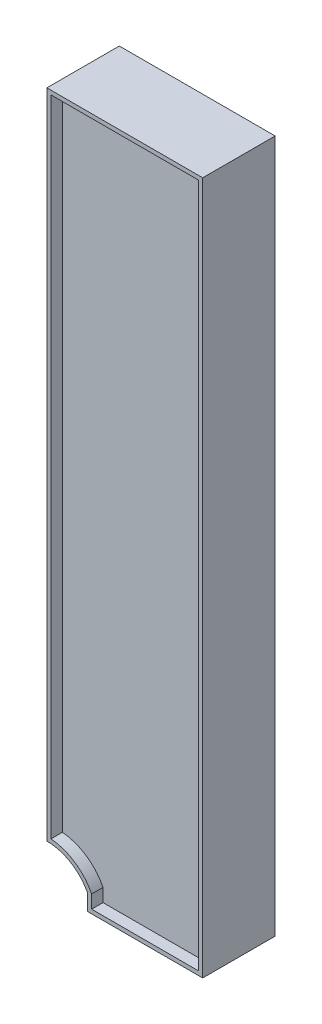
ISO-10303-21;
HEADER;
FILE_DESCRIPTION(('STEP AP214'),'2;1');
FILE_NAME('part.step','',(''),(''),'','','');
FILE_SCHEMA(('AUTOMOTIVE_DESIGN { 1 0 10303 214 1 1 1 1 }'));
ENDSEC;
DATA;
#1=APPLICATION_CONTEXT('core data for automotive mechanical design processes');
#2=APPLICATION_PROTOCOL_DEFINITION('international standard','automotive_design',2000,#1);
#3=PRODUCT_CONTEXT('',#1,'mechanical');
#4=PRODUCT('Part','Part','',(#3));
#5=PRODUCT_RELATED_PRODUCT_CATEGORY('part','',(#4));
#6=PRODUCT_DEFINITION_FORMATION('','',#4);
#7=PRODUCT_DEFINITION_CONTEXT('part definition',#1,'design');
#8=PRODUCT_DEFINITION('design','',#6,#7);
#9=PRODUCT_DEFINITION_SHAPE('','',#8);
#10=(LENGTH_UNIT() NAMED_UNIT(*) SI_UNIT(.MILLI.,.METRE.));
#11=(NAMED_UNIT(*) PLANE_ANGLE_UNIT() SI_UNIT($,.RADIAN.));
#12=(NAMED_UNIT(*) SI_UNIT($,.STERADIAN.) SOLID_ANGLE_UNIT());
#13=UNCERTAINTY_MEASURE_WITH_UNIT(LENGTH_MEASURE(1.E-05),#10,'distance_accuracy_value','');
#14=(GEOMETRIC_REPRESENTATION_CONTEXT(3) GLOBAL_UNCERTAINTY_ASSIGNED_CONTEXT((#13)) GLOBAL_UNIT_ASSIGNED_CONTEXT((#10,
#11,#12)) REPRESENTATION_CONTEXT('',''));
#15=CARTESIAN_POINT('',(0.,0.,0.));
#16=DIRECTION('',(0.,0.,1.));
#17=DIRECTION('',(1.,0.,0.));
#18=AXIS2_PLACEMENT_3D('',#15,#16,#17);
#19=CARTESIAN_POINT('',(0.,0.,0.));
#20=DIRECTION('',(0.,0.,-1.));
#21=DIRECTION('',(-1.,0.,0.));
#22=AXIS2_PLACEMENT_3D('',#19,#20,#21);
#23=PLANE('',#22);
#24=DIRECTION('',(0.,1.,0.));
#25=VECTOR('',#24,1.);
#26=CARTESIAN_POINT('',(50.,0.,0.));
#27=LINE('',#26,#25);
#28=CARTESIAN_POINT('',(50.,0.,0.));
#29=VERTEX_POINT('',#28);
#30=CARTESIAN_POINT('',(50.,20.,0.));
#31=VERTEX_POINT('',#30);
#32=EDGE_CURVE('E269',#29,#31,#27,.T.);
#33=ORIENTED_EDGE('',*,*,#32,.T.);
#34=CARTESIAN_POINT('',(0.,-6.66666666666667,0.));
#35=DIRECTION('',(0.,0.,-1.));
#36=DIRECTION('',(-1.,0.,0.));
#37=AXIS2_PLACEMENT_3D('',#34,#35,#36);
#38=CIRCLE('',#37,56.6666666666667);
#39=CARTESIAN_POINT('',(0.,50.,0.));
#40=VERTEX_POINT('',#39);
#41=EDGE_CURVE('E264',#31,#40,#38,.F.);
#42=ORIENTED_EDGE('',*,*,#41,.T.);
#43=DIRECTION('',(0.,-1.,0.));
#44=VECTOR('',#43,1.);
#45=CARTESIAN_POINT('',(0.,0.,0.));
#46=LINE('',#45,#44);
#47=CARTESIAN_POINT('',(0.,851.41,0.));
#48=VERTEX_POINT('',#47);
#49=EDGE_CURVE('E274',#48,#40,#46,.T.);
#50=ORIENTED_EDGE('',*,*,#49,.F.);
#51=DIRECTION('',(-1.,0.,0.));
#52=VECTOR('',#51,1.);
#53=CARTESIAN_POINT('',(0.,851.41,0.));
#54=LINE('',#53,#52);
#55=CARTESIAN_POINT('',(191.44,851.41,0.));
#56=VERTEX_POINT('',#55);
#57=EDGE_CURVE('E281',#56,#48,#54,.T.);
#58=ORIENTED_EDGE('',*,*,#57,.F.);
#59=DIRECTION('',(0.,1.,0.));
#60=VECTOR('',#59,1.);
#61=CARTESIAN_POINT('',(191.44,0.,0.));
#62=LINE('',#61,#60);
#63=CARTESIAN_POINT('',(191.44,0.,0.));
#64=VERTEX_POINT('',#63);
#65=EDGE_CURVE('E292',#64,#56,#62,.T.);
#66=ORIENTED_EDGE('',*,*,#65,.F.);
#67=DIRECTION('',(1.,0.,0.));
#68=VECTOR('',#67,1.);
#69=CARTESIAN_POINT('',(0.,0.,0.));
#70=LINE('',#69,#68);
#71=EDGE_CURVE('E290',#29,#64,#70,.T.);
#72=ORIENTED_EDGE('',*,*,#71,.F.);
#73=EDGE_LOOP('',(#33,#42,#50,#58,#66,#72));
#74=FACE_BOUND('',#73,.T.);
#75=DIRECTION('',(0.,-1.,0.));
#76=VECTOR('',#75,1.);
#77=CARTESIAN_POINT('',(5.,846.41,0.));
#78=LINE('',#77,#76);
#79=CARTESIAN_POINT('',(5.,846.41,0.));
#80=VERTEX_POINT('',#79);
#81=CARTESIAN_POINT('',(4.99999999999995,54.7969630486193,0.));
#82=VERTEX_POINT('',#81);
#83=EDGE_CURVE('E193',#80,#82,#78,.T.);
#84=ORIENTED_EDGE('',*,*,#83,.T.);
#85=CARTESIAN_POINT('',(0.,-6.66666666666667,0.));
#86=DIRECTION('',(0.,0.,-1.));
#87=DIRECTION('',(1.,0.,0.));
#88=AXIS2_PLACEMENT_3D('',#85,#86,#87);
#89=CIRCLE('',#88,61.6666666666667);
#90=CARTESIAN_POINT('',(55.,21.2220008844692,0.));
#91=VERTEX_POINT('',#90);
#92=EDGE_CURVE('E49',#82,#91,#89,.T.);
#93=ORIENTED_EDGE('',*,*,#92,.T.);
#94=DIRECTION('',(0.,-1.,0.));
#95=VECTOR('',#94,1.);
#96=CARTESIAN_POINT('',(55.,21.2220008844692,0.));
#97=LINE('',#96,#95);
#98=CARTESIAN_POINT('',(55.,5.,0.));
#99=VERTEX_POINT('',#98);
#100=EDGE_CURVE('E180',#91,#99,#97,.T.);
#101=ORIENTED_EDGE('',*,*,#100,.T.);
#102=DIRECTION('',(1.,0.,0.));
#103=VECTOR('',#102,1.);
#104=CARTESIAN_POINT('',(55.,5.,0.));
#105=LINE('',#104,#103);
#106=CARTESIAN_POINT('',(186.44,5.,0.));
#107=VERTEX_POINT('',#106);
#108=EDGE_CURVE('E183',#99,#107,#105,.T.);
#109=ORIENTED_EDGE('',*,*,#108,.T.);
#110=DIRECTION('',(0.,1.,0.));
#111=VECTOR('',#110,1.);
#112=CARTESIAN_POINT('',(186.44,5.,0.));
#113=LINE('',#112,#111);
#114=CARTESIAN_POINT('',(186.44,846.41,0.));
#115=VERTEX_POINT('',#114);
#116=EDGE_CURVE('E198',#107,#115,#113,.T.);
#117=ORIENTED_EDGE('',*,*,#116,.T.);
#118=DIRECTION('',(-1.,0.,0.));
#119=VECTOR('',#118,1.);
#120=CARTESIAN_POINT('',(186.44,846.41,0.));
#121=LINE('',#120,#119);
#122=EDGE_CURVE('E195',#115,#80,#121,.T.);
#123=ORIENTED_EDGE('',*,*,#122,.T.);
#124=EDGE_LOOP('',(#84,#93,#101,#109,#117,#123));
#125=FACE_BOUND('',#124,.T.);
#126=ADVANCED_FACE('F34',(#74,#125),#23,.T.);
#127=CARTESIAN_POINT('',(0.,0.,89.));
#128=DIRECTION('',(1.,0.,0.));
#129=DIRECTION('',(0.,0.,-1.));
#130=AXIS2_PLACEMENT_3D('',#127,#128,#129);
#131=PLANE('',#130);
#132=ORIENTED_EDGE('',*,*,#49,.T.);
#133=DIRECTION('',(0.,0.,1.));
#134=VECTOR('',#133,1.);
#135=CARTESIAN_POINT('',(0.,50.,-139.755997434306));
#136=LINE('',#135,#134);
#137=CARTESIAN_POINT('',(0.,50.,89.));
#138=VERTEX_POINT('',#137);
#139=EDGE_CURVE('E267',#40,#138,#136,.T.);
#140=ORIENTED_EDGE('',*,*,#139,.T.);
#141=DIRECTION('',(0.,-1.,0.));
#142=VECTOR('',#141,1.);
#143=CARTESIAN_POINT('',(0.,0.,89.));
#144=LINE('',#143,#142);
#145=CARTESIAN_POINT('',(0.,851.41,89.));
#146=VERTEX_POINT('',#145);
#147=EDGE_CURVE('E277',#146,#138,#144,.T.);
#148=ORIENTED_EDGE('',*,*,#147,.F.);
#149=DIRECTION('',(0.,0.,-1.));
#150=VECTOR('',#149,1.);
#151=CARTESIAN_POINT('',(0.,851.41,89.));
#152=LINE('',#151,#150);
#153=EDGE_CURVE('E287',#146,#48,#152,.T.);
#154=ORIENTED_EDGE('',*,*,#153,.T.);
#155=EDGE_LOOP('',(#132,#140,#148,#154));
#156=FACE_BOUND('',#155,.T.);
#157=ADVANCED_FACE('F36',(#156),#131,.F.);
#158=CARTESIAN_POINT('',(0.,0.,89.));
#159=DIRECTION('',(0.,1.,0.));
#160=DIRECTION('',(0.,0.,1.));
#161=AXIS2_PLACEMENT_3D('',#158,#159,#160);
#162=PLANE('',#161);
#163=DIRECTION('',(1.,0.,0.));
#164=VECTOR('',#163,1.);
#165=CARTESIAN_POINT('',(0.,0.,89.));
#166=LINE('',#165,#164);
#167=CARTESIAN_POINT('',(50.,0.,89.));
#168=VERTEX_POINT('',#167);
#169=CARTESIAN_POINT('',(191.44,0.,89.));
#170=VERTEX_POINT('',#169);
#171=EDGE_CURVE('E280',#168,#170,#166,.T.);
#172=ORIENTED_EDGE('',*,*,#171,.F.);
#173=DIRECTION('',(0.,0.,1.));
#174=VECTOR('',#173,1.);
#175=CARTESIAN_POINT('',(50.,0.,-139.755997434306));
#176=LINE('',#175,#174);
#177=EDGE_CURVE('E261',#29,#168,#176,.T.);
#178=ORIENTED_EDGE('',*,*,#177,.F.);
#179=ORIENTED_EDGE('',*,*,#71,.T.);
#180=DIRECTION('',(0.,0.,-1.));
#181=VECTOR('',#180,1.);
#182=CARTESIAN_POINT('',(191.44,0.,89.));
#183=LINE('',#182,#181);
#184=EDGE_CURVE('E11',#170,#64,#183,.T.);
#185=ORIENTED_EDGE('',*,*,#184,.F.);
#186=EDGE_LOOP('',(#172,#178,#179,#185));
#187=FACE_BOUND('',#186,.T.);
#188=ADVANCED_FACE('F320',(#187),#162,.F.);
#189=CARTESIAN_POINT('',(191.44,0.,89.));
#190=DIRECTION('',(-1.,0.,0.));
#191=DIRECTION('',(0.,0.,1.));
#192=AXIS2_PLACEMENT_3D('',#189,#190,#191);
#193=PLANE('',#192);
#194=ORIENTED_EDGE('',*,*,#65,.T.);
#195=DIRECTION('',(0.,0.,-1.));
#196=VECTOR('',#195,1.);
#197=CARTESIAN_POINT('',(191.44,851.41,89.));
#198=LINE('',#197,#196);
#199=CARTESIAN_POINT('',(191.44,851.41,89.));
#200=VERTEX_POINT('',#199);
#201=EDGE_CURVE('E42',#200,#56,#198,.T.);
#202=ORIENTED_EDGE('',*,*,#201,.F.);
#203=DIRECTION('',(0.,1.,0.));
#204=VECTOR('',#203,1.);
#205=CARTESIAN_POINT('',(191.44,0.,89.));
#206=LINE('',#205,#204);
#207=EDGE_CURVE('E283',#170,#200,#206,.T.);
#208=ORIENTED_EDGE('',*,*,#207,.F.);
#209=ORIENTED_EDGE('',*,*,#184,.T.);
#210=EDGE_LOOP('',(#194,#202,#208,#209));
#211=FACE_BOUND('',#210,.T.);
#212=ADVANCED_FACE('F318',(#211),#193,.F.);
#213=CARTESIAN_POINT('',(0.,851.41,89.));
#214=DIRECTION('',(0.,-1.,0.));
#215=DIRECTION('',(0.,0.,-1.));
#216=AXIS2_PLACEMENT_3D('',#213,#214,#215);
#217=PLANE('',#216);
#218=ORIENTED_EDGE('',*,*,#57,.T.);
#219=ORIENTED_EDGE('',*,*,#153,.F.);
#220=DIRECTION('',(-1.,0.,0.));
#221=VECTOR('',#220,1.);
#222=CARTESIAN_POINT('',(0.,851.41,89.));
#223=LINE('',#222,#221);
#224=EDGE_CURVE('E285',#200,#146,#223,.T.);
#225=ORIENTED_EDGE('',*,*,#224,.F.);
#226=ORIENTED_EDGE('',*,*,#201,.T.);
#227=EDGE_LOOP('',(#218,#219,#225,#226));
#228=FACE_BOUND('',#227,.T.);
#229=ADVANCED_FACE('F301',(#228),#217,.F.);
#230=CARTESIAN_POINT('',(0.,0.,89.));
#231=DIRECTION('',(0.,0.,-1.));
#232=DIRECTION('',(-1.,0.,0.));
#233=AXIS2_PLACEMENT_3D('',#230,#231,#232);
#234=PLANE('',#233);
#235=DIRECTION('',(0.,-1.,0.));
#236=VECTOR('',#235,1.);
#237=CARTESIAN_POINT('',(55.,21.2220008844692,89.));
#238=LINE('',#237,#236);
#239=CARTESIAN_POINT('',(55.,21.2220008844692,89.));
#240=VERTEX_POINT('',#239);
#241=CARTESIAN_POINT('',(55.,5.,89.));
#242=VERTEX_POINT('',#241);
#243=EDGE_CURVE('E233',#240,#242,#238,.T.);
#244=ORIENTED_EDGE('',*,*,#243,.F.);
#245=CARTESIAN_POINT('',(0.,-6.66666666666667,89.));
#246=DIRECTION('',(0.,0.,-1.));
#247=DIRECTION('',(1.,0.,0.));
#248=AXIS2_PLACEMENT_3D('',#245,#246,#247);
#249=CIRCLE('',#248,61.6666666666667);
#250=CARTESIAN_POINT('',(4.99999999999995,54.7969630486193,89.));
#251=VERTEX_POINT('',#250);
#252=EDGE_CURVE('E57',#251,#240,#249,.T.);
#253=ORIENTED_EDGE('',*,*,#252,.F.);
#254=DIRECTION('',(0.,-1.,0.));
#255=VECTOR('',#254,1.);
#256=CARTESIAN_POINT('',(5.,846.41,89.));
#257=LINE('',#256,#255);
#258=CARTESIAN_POINT('',(5.,846.41,89.));
#259=VERTEX_POINT('',#258);
#260=EDGE_CURVE('E216',#259,#251,#257,.T.);
#261=ORIENTED_EDGE('',*,*,#260,.F.);
#262=DIRECTION('',(-1.,0.,0.));
#263=VECTOR('',#262,1.);
#264=CARTESIAN_POINT('',(186.44,846.41,89.));
#265=LINE('',#264,#263);
#266=CARTESIAN_POINT('',(186.44,846.41,89.));
#267=VERTEX_POINT('',#266);
#268=EDGE_CURVE('E242',#267,#259,#265,.T.);
#269=ORIENTED_EDGE('',*,*,#268,.F.);
#270=DIRECTION('',(0.,1.,0.));
#271=VECTOR('',#270,1.);
#272=CARTESIAN_POINT('',(186.44,5.,89.));
#273=LINE('',#272,#271);
#274=CARTESIAN_POINT('',(186.44,5.,89.));
#275=VERTEX_POINT('',#274);
#276=EDGE_CURVE('E239',#275,#267,#273,.T.);
#277=ORIENTED_EDGE('',*,*,#276,.F.);
#278=DIRECTION('',(1.,0.,0.));
#279=VECTOR('',#278,1.);
#280=CARTESIAN_POINT('',(55.,5.,89.));
#281=LINE('',#280,#279);
#282=EDGE_CURVE('E236',#242,#275,#281,.T.);
#283=ORIENTED_EDGE('',*,*,#282,.F.);
#284=EDGE_LOOP('',(#244,#253,#261,#269,#277,#283));
#285=FACE_BOUND('',#284,.T.);
#286=CARTESIAN_POINT('',(0.,-6.66666666666667,89.));
#287=DIRECTION('',(0.,0.,1.));
#288=DIRECTION('',(1.,0.,0.));
#289=AXIS2_PLACEMENT_3D('',#286,#287,#288);
#290=CIRCLE('',#289,56.6666666666667);
#291=CARTESIAN_POINT('',(50.,20.,89.));
#292=VERTEX_POINT('',#291);
#293=EDGE_CURVE('E259',#292,#138,#290,.T.);
#294=ORIENTED_EDGE('',*,*,#293,.F.);
#295=DIRECTION('',(0.,1.,0.));
#296=VECTOR('',#295,1.);
#297=CARTESIAN_POINT('',(50.,0.,89.));
#298=LINE('',#297,#296);
#299=EDGE_CURVE('E249',#168,#292,#298,.T.);
#300=ORIENTED_EDGE('',*,*,#299,.F.);
#301=ORIENTED_EDGE('',*,*,#171,.T.);
#302=ORIENTED_EDGE('',*,*,#207,.T.);
#303=ORIENTED_EDGE('',*,*,#224,.T.);
#304=ORIENTED_EDGE('',*,*,#147,.T.);
#305=EDGE_LOOP('',(#294,#300,#301,#302,#303,#304));
#306=FACE_BOUND('',#305,.T.);
#307=ADVANCED_FACE('F314',(#285,#306),#234,.F.);
#308=CARTESIAN_POINT('',(50.,0.,-139.755997434306));
#309=DIRECTION('',(1.,0.,0.));
#310=DIRECTION('',(0.,0.,-1.));
#311=AXIS2_PLACEMENT_3D('',#308,#309,#310);
#312=PLANE('',#311);
#313=ORIENTED_EDGE('',*,*,#177,.T.);
#314=ORIENTED_EDGE('',*,*,#299,.T.);
#315=DIRECTION('',(0.,0.,1.));
#316=VECTOR('',#315,1.);
#317=CARTESIAN_POINT('',(50.,20.,-139.755997434306));
#318=LINE('',#317,#316);
#319=EDGE_CURVE('E268',#31,#292,#318,.T.);
#320=ORIENTED_EDGE('',*,*,#319,.F.);
#321=ORIENTED_EDGE('',*,*,#32,.F.);
#322=EDGE_LOOP('',(#313,#314,#320,#321));
#323=FACE_BOUND('',#322,.T.);
#324=ADVANCED_FACE('F324',(#323),#312,.F.);
#325=CARTESIAN_POINT('',(0.,-6.66666666666667,-139.755997434306));
#326=DIRECTION('',(0.,0.,1.));
#327=DIRECTION('',(1.,0.,0.));
#328=AXIS2_PLACEMENT_3D('',#325,#326,#327);
#329=CYLINDRICAL_SURFACE('',#328,56.6666666666667);
#330=ORIENTED_EDGE('',*,*,#319,.T.);
#331=ORIENTED_EDGE('',*,*,#293,.T.);
#332=ORIENTED_EDGE('',*,*,#139,.F.);
#333=ORIENTED_EDGE('',*,*,#41,.F.);
#334=EDGE_LOOP('',(#330,#331,#332,#333));
#335=FACE_BOUND('',#334,.T.);
#336=ADVANCED_FACE('F326',(#335),#329,.F.);
#337=CARTESIAN_POINT('',(0.,-6.66666666666667,75.));
#338=DIRECTION('',(0.,0.,1.));
#339=DIRECTION('',(1.,0.,0.));
#340=AXIS2_PLACEMENT_3D('',#337,#338,#339);
#341=CYLINDRICAL_SURFACE('',#340,61.6666666666667);
#342=ORIENTED_EDGE('',*,*,#252,.T.);
#343=DIRECTION('',(0.,0.,1.));
#344=VECTOR('',#343,1.);
#345=CARTESIAN_POINT('',(55.,21.2220008844692,75.));
#346=LINE('',#345,#344);
#347=CARTESIAN_POINT('',(55.,21.2220008844692,75.));
#348=VERTEX_POINT('',#347);
#349=EDGE_CURVE('E231',#348,#240,#346,.T.);
#350=ORIENTED_EDGE('',*,*,#349,.F.);
#351=CARTESIAN_POINT('',(0.,-6.66666666666667,75.));
#352=DIRECTION('',(0.,0.,-1.));
#353=DIRECTION('',(1.,0.,0.));
#354=AXIS2_PLACEMENT_3D('',#351,#352,#353);
#355=CIRCLE('',#354,61.6666666666667);
#356=CARTESIAN_POINT('',(4.99999999999995,54.7969630486193,75.));
#357=VERTEX_POINT('',#356);
#358=EDGE_CURVE('E212',#357,#348,#355,.T.);
#359=ORIENTED_EDGE('',*,*,#358,.F.);
#360=DIRECTION('',(0.,0.,1.));
#361=VECTOR('',#360,1.);
#362=CARTESIAN_POINT('',(4.99999999999995,54.7969630486193,75.));
#363=LINE('',#362,#361);
#364=EDGE_CURVE('E247',#357,#251,#363,.T.);
#365=ORIENTED_EDGE('',*,*,#364,.T.);
#366=EDGE_LOOP('',(#342,#350,#359,#365));
#367=FACE_BOUND('',#366,.T.);
#368=ADVANCED_FACE('F328',(#367),#341,.T.);
#369=CARTESIAN_POINT('',(5.,846.41,75.));
#370=DIRECTION('',(-1.,0.,0.));
#371=DIRECTION('',(0.,-1.,0.));
#372=AXIS2_PLACEMENT_3D('',#369,#370,#371);
#373=PLANE('',#372);
#374=ORIENTED_EDGE('',*,*,#260,.T.);
#375=ORIENTED_EDGE('',*,*,#364,.F.);
#376=DIRECTION('',(0.,-1.,0.));
#377=VECTOR('',#376,1.);
#378=CARTESIAN_POINT('',(5.,846.41,75.));
#379=LINE('',#378,#377);
#380=CARTESIAN_POINT('',(5.,846.41,75.));
#381=VERTEX_POINT('',#380);
#382=EDGE_CURVE('E228',#381,#357,#379,.T.);
#383=ORIENTED_EDGE('',*,*,#382,.F.);
#384=DIRECTION('',(0.,0.,1.));
#385=VECTOR('',#384,1.);
#386=CARTESIAN_POINT('',(5.,846.41,75.));
#387=LINE('',#386,#385);
#388=EDGE_CURVE('E250',#381,#259,#387,.T.);
#389=ORIENTED_EDGE('',*,*,#388,.T.);
#390=EDGE_LOOP('',(#374,#375,#383,#389));
#391=FACE_BOUND('',#390,.T.);
#392=ADVANCED_FACE('F334',(#391),#373,.F.);
#393=CARTESIAN_POINT('',(186.44,846.41,75.));
#394=DIRECTION('',(0.,1.,0.));
#395=DIRECTION('',(0.,0.,1.));
#396=AXIS2_PLACEMENT_3D('',#393,#394,#395);
#397=PLANE('',#396);
#398=ORIENTED_EDGE('',*,*,#268,.T.);
#399=ORIENTED_EDGE('',*,*,#388,.F.);
#400=DIRECTION('',(-1.,0.,0.));
#401=VECTOR('',#400,1.);
#402=CARTESIAN_POINT('',(186.44,846.41,75.));
#403=LINE('',#402,#401);
#404=CARTESIAN_POINT('',(186.44,846.41,75.));
#405=VERTEX_POINT('',#404);
#406=EDGE_CURVE('E225',#405,#381,#403,.T.);
#407=ORIENTED_EDGE('',*,*,#406,.F.);
#408=DIRECTION('',(0.,0.,1.));
#409=VECTOR('',#408,1.);
#410=CARTESIAN_POINT('',(186.44,846.41,75.));
#411=LINE('',#410,#409);
#412=EDGE_CURVE('E252',#405,#267,#411,.T.);
#413=ORIENTED_EDGE('',*,*,#412,.T.);
#414=EDGE_LOOP('',(#398,#399,#407,#413));
#415=FACE_BOUND('',#414,.T.);
#416=ADVANCED_FACE('F389',(#415),#397,.F.);
#417=CARTESIAN_POINT('',(186.44,5.,75.));
#418=DIRECTION('',(1.,0.,0.));
#419=DIRECTION('',(0.,0.,-1.));
#420=AXIS2_PLACEMENT_3D('',#417,#418,#419);
#421=PLANE('',#420);
#422=ORIENTED_EDGE('',*,*,#276,.T.);
#423=ORIENTED_EDGE('',*,*,#412,.F.);
#424=DIRECTION('',(0.,1.,0.));
#425=VECTOR('',#424,1.);
#426=CARTESIAN_POINT('',(186.44,5.,75.));
#427=LINE('',#426,#425);
#428=CARTESIAN_POINT('',(186.44,5.,75.));
#429=VERTEX_POINT('',#428);
#430=EDGE_CURVE('E222',#429,#405,#427,.T.);
#431=ORIENTED_EDGE('',*,*,#430,.F.);
#432=DIRECTION('',(0.,0.,1.));
#433=VECTOR('',#432,1.);
#434=CARTESIAN_POINT('',(186.44,5.,75.));
#435=LINE('',#434,#433);
#436=EDGE_CURVE('E254',#429,#275,#435,.T.);
#437=ORIENTED_EDGE('',*,*,#436,.T.);
#438=EDGE_LOOP('',(#422,#423,#431,#437));
#439=FACE_BOUND('',#438,.T.);
#440=ADVANCED_FACE('F398',(#439),#421,.F.);
#441=CARTESIAN_POINT('',(55.,5.,75.));
#442=DIRECTION('',(0.,-1.,0.));
#443=DIRECTION('',(0.,0.,-1.));
#444=AXIS2_PLACEMENT_3D('',#441,#442,#443);
#445=PLANE('',#444);
#446=ORIENTED_EDGE('',*,*,#282,.T.);
#447=ORIENTED_EDGE('',*,*,#436,.F.);
#448=DIRECTION('',(1.,0.,0.));
#449=VECTOR('',#448,1.);
#450=CARTESIAN_POINT('',(55.,5.,75.));
#451=LINE('',#450,#449);
#452=CARTESIAN_POINT('',(55.,5.,75.));
#453=VERTEX_POINT('',#452);
#454=EDGE_CURVE('E219',#453,#429,#451,.T.);
#455=ORIENTED_EDGE('',*,*,#454,.F.);
#456=DIRECTION('',(0.,0.,1.));
#457=VECTOR('',#456,1.);
#458=CARTESIAN_POINT('',(55.,5.,75.));
#459=LINE('',#458,#457);
#460=EDGE_CURVE('E256',#453,#242,#459,.T.);
#461=ORIENTED_EDGE('',*,*,#460,.T.);
#462=EDGE_LOOP('',(#446,#447,#455,#461));
#463=FACE_BOUND('',#462,.T.);
#464=ADVANCED_FACE('F407',(#463),#445,.F.);
#465=CARTESIAN_POINT('',(55.,21.2220008844692,75.));
#466=DIRECTION('',(-1.,0.,0.));
#467=DIRECTION('',(0.,0.,1.));
#468=AXIS2_PLACEMENT_3D('',#465,#466,#467);
#469=PLANE('',#468);
#470=ORIENTED_EDGE('',*,*,#243,.T.);
#471=ORIENTED_EDGE('',*,*,#460,.F.);
#472=DIRECTION('',(0.,-1.,0.));
#473=VECTOR('',#472,1.);
#474=CARTESIAN_POINT('',(55.,21.2220008844692,75.));
#475=LINE('',#474,#473);
#476=EDGE_CURVE('E215',#348,#453,#475,.T.);
#477=ORIENTED_EDGE('',*,*,#476,.F.);
#478=ORIENTED_EDGE('',*,*,#349,.T.);
#479=EDGE_LOOP('',(#470,#471,#477,#478));
#480=FACE_BOUND('',#479,.T.);
#481=ADVANCED_FACE('F416',(#480),#469,.F.);
#482=CARTESIAN_POINT('',(0.,-6.66666666666667,75.));
#483=DIRECTION('',(0.,0.,1.));
#484=DIRECTION('',(1.,0.,0.));
#485=AXIS2_PLACEMENT_3D('',#482,#483,#484);
#486=PLANE('',#485);
#487=ORIENTED_EDGE('',*,*,#358,.T.);
#488=ORIENTED_EDGE('',*,*,#476,.T.);
#489=ORIENTED_EDGE('',*,*,#454,.T.);
#490=ORIENTED_EDGE('',*,*,#430,.T.);
#491=ORIENTED_EDGE('',*,*,#406,.T.);
#492=ORIENTED_EDGE('',*,*,#382,.T.);
#493=EDGE_LOOP('',(#487,#488,#489,#490,#491,#492));
#494=FACE_BOUND('',#493,.T.);
#495=ADVANCED_FACE('F425',(#494),#486,.T.);
#496=CARTESIAN_POINT('',(0.,-6.66666666666667,14.));
#497=DIRECTION('',(0.,0.,-1.));
#498=DIRECTION('',(-1.,0.,0.));
#499=AXIS2_PLACEMENT_3D('',#496,#497,#498);
#500=CYLINDRICAL_SURFACE('',#499,61.6666666666667);
#501=ORIENTED_EDGE('',*,*,#92,.F.);
#502=DIRECTION('',(0.,0.,-1.));
#503=VECTOR('',#502,1.);
#504=CARTESIAN_POINT('',(4.99999999999995,54.7969630486193,14.));
#505=LINE('',#504,#503);
#506=CARTESIAN_POINT('',(4.99999999999995,54.7969630486193,14.));
#507=VERTEX_POINT('',#506);
#508=EDGE_CURVE('E164',#507,#82,#505,.T.);
#509=ORIENTED_EDGE('',*,*,#508,.F.);
#510=CARTESIAN_POINT('',(0.,-6.66666666666667,14.));
#511=DIRECTION('',(0.,0.,-1.));
#512=DIRECTION('',(1.,0.,0.));
#513=AXIS2_PLACEMENT_3D('',#510,#511,#512);
#514=CIRCLE('',#513,61.6666666666667);
#515=CARTESIAN_POINT('',(55.,21.2220008844692,14.));
#516=VERTEX_POINT('',#515);
#517=EDGE_CURVE('E171',#507,#516,#514,.T.);
#518=ORIENTED_EDGE('',*,*,#517,.T.);
#519=DIRECTION('',(0.,0.,-1.));
#520=VECTOR('',#519,1.);
#521=CARTESIAN_POINT('',(55.,21.2220008844692,14.));
#522=LINE('',#521,#520);
#523=EDGE_CURVE('E203',#516,#91,#522,.T.);
#524=ORIENTED_EDGE('',*,*,#523,.T.);
#525=EDGE_LOOP('',(#501,#509,#518,#524));
#526=FACE_BOUND('',#525,.T.);
#527=ADVANCED_FACE('F174',(#526),#500,.T.);
#528=CARTESIAN_POINT('',(55.,21.2220008844692,14.));
#529=DIRECTION('',(1.,0.,0.));
#530=DIRECTION('',(0.,0.,-1.));
#531=AXIS2_PLACEMENT_3D('',#528,#529,#530);
#532=PLANE('',#531);
#533=ORIENTED_EDGE('',*,*,#100,.F.);
#534=ORIENTED_EDGE('',*,*,#523,.F.);
#535=DIRECTION('',(0.,-1.,0.));
#536=VECTOR('',#535,1.);
#537=CARTESIAN_POINT('',(55.,21.2220008844692,14.));
#538=LINE('',#537,#536);
#539=CARTESIAN_POINT('',(55.,5.,14.));
#540=VERTEX_POINT('',#539);
#541=EDGE_CURVE('E176',#516,#540,#538,.T.);
#542=ORIENTED_EDGE('',*,*,#541,.T.);
#543=DIRECTION('',(0.,0.,-1.));
#544=VECTOR('',#543,1.);
#545=CARTESIAN_POINT('',(55.,5.,14.));
#546=LINE('',#545,#544);
#547=EDGE_CURVE('E205',#540,#99,#546,.T.);
#548=ORIENTED_EDGE('',*,*,#547,.T.);
#549=EDGE_LOOP('',(#533,#534,#542,#548));
#550=FACE_BOUND('',#549,.T.);
#551=ADVANCED_FACE('F446',(#550),#532,.T.);
#552=CARTESIAN_POINT('',(55.,5.,14.));
#553=DIRECTION('',(0.,1.,0.));
#554=DIRECTION('',(0.,0.,1.));
#555=AXIS2_PLACEMENT_3D('',#552,#553,#554);
#556=PLANE('',#555);
#557=ORIENTED_EDGE('',*,*,#108,.F.);
#558=ORIENTED_EDGE('',*,*,#547,.F.);
#559=DIRECTION('',(1.,0.,0.));
#560=VECTOR('',#559,1.);
#561=CARTESIAN_POINT('',(55.,5.,14.));
#562=LINE('',#561,#560);
#563=CARTESIAN_POINT('',(186.44,5.,14.));
#564=VERTEX_POINT('',#563);
#565=EDGE_CURVE('E189',#540,#564,#562,.T.);
#566=ORIENTED_EDGE('',*,*,#565,.T.);
#567=DIRECTION('',(0.,0.,-1.));
#568=VECTOR('',#567,1.);
#569=CARTESIAN_POINT('',(186.44,5.,14.));
#570=LINE('',#569,#568);
#571=EDGE_CURVE('E207',#564,#107,#570,.T.);
#572=ORIENTED_EDGE('',*,*,#571,.T.);
#573=EDGE_LOOP('',(#557,#558,#566,#572));
#574=FACE_BOUND('',#573,.T.);
#575=ADVANCED_FACE('F454',(#574),#556,.T.);
#576=CARTESIAN_POINT('',(186.44,5.,14.));
#577=DIRECTION('',(-1.,0.,0.));
#578=DIRECTION('',(0.,0.,1.));
#579=AXIS2_PLACEMENT_3D('',#576,#577,#578);
#580=PLANE('',#579);
#581=ORIENTED_EDGE('',*,*,#116,.F.);
#582=ORIENTED_EDGE('',*,*,#571,.F.);
#583=DIRECTION('',(0.,1.,0.));
#584=VECTOR('',#583,1.);
#585=CARTESIAN_POINT('',(186.44,5.,14.));
#586=LINE('',#585,#584);
#587=CARTESIAN_POINT('',(186.44,846.41,14.));
#588=VERTEX_POINT('',#587);
#589=EDGE_CURVE('E187',#564,#588,#586,.T.);
#590=ORIENTED_EDGE('',*,*,#589,.T.);
#591=DIRECTION('',(0.,0.,-1.));
#592=VECTOR('',#591,1.);
#593=CARTESIAN_POINT('',(186.44,846.41,14.));
#594=LINE('',#593,#592);
#595=EDGE_CURVE('E209',#588,#115,#594,.T.);
#596=ORIENTED_EDGE('',*,*,#595,.T.);
#597=EDGE_LOOP('',(#581,#582,#590,#596));
#598=FACE_BOUND('',#597,.T.);
#599=ADVANCED_FACE('F463',(#598),#580,.T.);
#600=CARTESIAN_POINT('',(186.44,846.41,14.));
#601=DIRECTION('',(0.,-1.,0.));
#602=DIRECTION('',(0.,0.,-1.));
#603=AXIS2_PLACEMENT_3D('',#600,#601,#602);
#604=PLANE('',#603);
#605=ORIENTED_EDGE('',*,*,#122,.F.);
#606=ORIENTED_EDGE('',*,*,#595,.F.);
#607=DIRECTION('',(-1.,0.,0.));
#608=VECTOR('',#607,1.);
#609=CARTESIAN_POINT('',(186.44,846.41,14.));
#610=LINE('',#609,#608);
#611=CARTESIAN_POINT('',(5.,846.41,14.));
#612=VERTEX_POINT('',#611);
#613=EDGE_CURVE('E170',#588,#612,#610,.T.);
#614=ORIENTED_EDGE('',*,*,#613,.T.);
#615=DIRECTION('',(0.,0.,-1.));
#616=VECTOR('',#615,1.);
#617=CARTESIAN_POINT('',(5.,846.41,14.));
#618=LINE('',#617,#616);
#619=EDGE_CURVE('E166',#612,#80,#618,.T.);
#620=ORIENTED_EDGE('',*,*,#619,.T.);
#621=EDGE_LOOP('',(#605,#606,#614,#620));
#622=FACE_BOUND('',#621,.T.);
#623=ADVANCED_FACE('F472',(#622),#604,.T.);
#624=CARTESIAN_POINT('',(5.,846.41,14.));
#625=DIRECTION('',(1.,0.,0.));
#626=DIRECTION('',(0.,1.,0.));
#627=AXIS2_PLACEMENT_3D('',#624,#625,#626);
#628=PLANE('',#627);
#629=ORIENTED_EDGE('',*,*,#83,.F.);
#630=ORIENTED_EDGE('',*,*,#619,.F.);
#631=DIRECTION('',(0.,-1.,0.));
#632=VECTOR('',#631,1.);
#633=CARTESIAN_POINT('',(5.,846.41,14.));
#634=LINE('',#633,#632);
#635=EDGE_CURVE('E161',#612,#507,#634,.T.);
#636=ORIENTED_EDGE('',*,*,#635,.T.);
#637=ORIENTED_EDGE('',*,*,#508,.T.);
#638=EDGE_LOOP('',(#629,#630,#636,#637));
#639=FACE_BOUND('',#638,.T.);
#640=ADVANCED_FACE('F163',(#639),#628,.T.);
#641=CARTESIAN_POINT('',(0.,-6.66666666666667,14.));
#642=DIRECTION('',(0.,0.,-1.));
#643=DIRECTION('',(1.,0.,0.));
#644=AXIS2_PLACEMENT_3D('',#641,#642,#643);
#645=PLANE('',#644);
#646=ORIENTED_EDGE('',*,*,#517,.F.);
#647=ORIENTED_EDGE('',*,*,#635,.F.);
#648=ORIENTED_EDGE('',*,*,#613,.F.);
#649=ORIENTED_EDGE('',*,*,#589,.F.);
#650=ORIENTED_EDGE('',*,*,#565,.F.);
#651=ORIENTED_EDGE('',*,*,#541,.F.);
#652=EDGE_LOOP('',(#646,#647,#648,#649,#650,#651));
#653=FACE_BOUND('',#652,.T.);
#654=ADVANCED_FACE('F178',(#653),#645,.T.);
#655=CLOSED_SHELL('',(#126,#157,#188,#212,#229,#307,#324,#336,#368,#392,#416,#440,#464,#481,
#495,#527,#551,#575,#599,#623,#640,#654));
#656=MANIFOLD_SOLID_BREP('B2',#655);
#657=ADVANCED_BREP_SHAPE_REPRESENTATION('',(#18,#656),#14);
#658=SHAPE_DEFINITION_REPRESENTATION(#9,#657);
ENDSEC;
END-ISO-10303-21;
